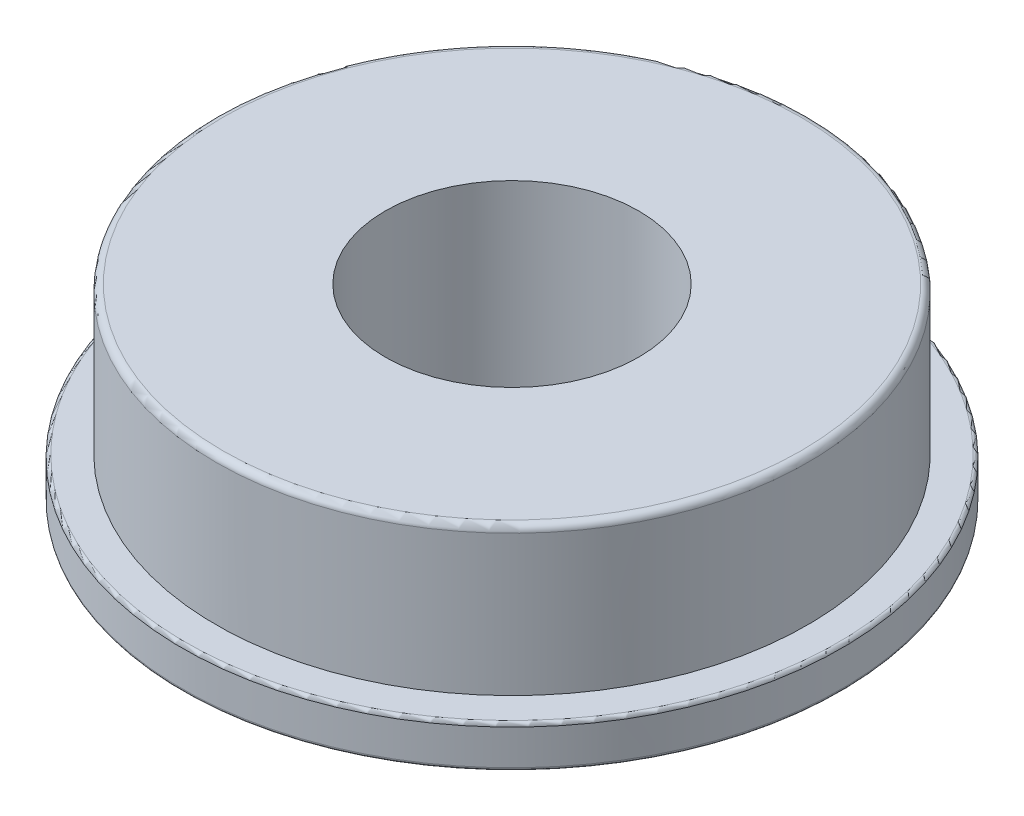
ISO-10303-21;
HEADER;
FILE_DESCRIPTION(('STEP AP214'),'2;1');
FILE_NAME('part.step','',(''),(''),'','','');
FILE_SCHEMA(('AUTOMOTIVE_DESIGN { 1 0 10303 214 1 1 1 1 }'));
ENDSEC;
DATA;
#1=APPLICATION_CONTEXT('core data for automotive mechanical design processes');
#2=APPLICATION_PROTOCOL_DEFINITION('international standard','automotive_design',2000,#1);
#3=PRODUCT_CONTEXT('',#1,'mechanical');
#4=PRODUCT('Part','Part','',(#3));
#5=PRODUCT_RELATED_PRODUCT_CATEGORY('part','',(#4));
#6=PRODUCT_DEFINITION_FORMATION('','',#4);
#7=PRODUCT_DEFINITION_CONTEXT('part definition',#1,'design');
#8=PRODUCT_DEFINITION('design','',#6,#7);
#9=PRODUCT_DEFINITION_SHAPE('','',#8);
#10=(LENGTH_UNIT() NAMED_UNIT(*) SI_UNIT(.MILLI.,.METRE.));
#11=(NAMED_UNIT(*) PLANE_ANGLE_UNIT() SI_UNIT($,.RADIAN.));
#12=(NAMED_UNIT(*) SI_UNIT($,.STERADIAN.) SOLID_ANGLE_UNIT());
#13=UNCERTAINTY_MEASURE_WITH_UNIT(LENGTH_MEASURE(1.E-05),#10,'distance_accuracy_value','');
#14=(GEOMETRIC_REPRESENTATION_CONTEXT(3) GLOBAL_UNCERTAINTY_ASSIGNED_CONTEXT((#13)) GLOBAL_UNIT_ASSIGNED_CONTEXT((#10,
#11,#12)) REPRESENTATION_CONTEXT('',''));
#15=CARTESIAN_POINT('',(0.,0.,0.));
#16=DIRECTION('',(0.,0.,1.));
#17=DIRECTION('',(1.,0.,0.));
#18=AXIS2_PLACEMENT_3D('',#15,#16,#17);
#19=CARTESIAN_POINT('',(0.,0.,0.));
#20=DIRECTION('',(0.,-1.,0.));
#21=DIRECTION('',(0.,0.,-1.));
#22=AXIS2_PLACEMENT_3D('',#19,#20,#21);
#23=CYLINDRICAL_SURFACE('',#22,11.1125);
#24=CARTESIAN_POINT('',(0.,1.5748,0.));
#25=DIRECTION('',(0.,-1.,0.));
#26=DIRECTION('',(0.,0.,-1.));
#27=AXIS2_PLACEMENT_3D('',#24,#25,#26);
#28=CIRCLE('',#27,11.1125);
#29=CARTESIAN_POINT('',(0.,1.5748,-11.1125));
#30=VERTEX_POINT('',#29);
#31=EDGE_CURVE('E19',#30,#30,#28,.T.);
#32=ORIENTED_EDGE('',*,*,#31,.F.);
#33=EDGE_LOOP('',(#32));
#34=FACE_BOUND('',#33,.T.);
#35=CARTESIAN_POINT('',(0.,6.858,0.));
#36=DIRECTION('',(0.,1.,0.));
#37=DIRECTION('',(-1.,0.,0.));
#38=AXIS2_PLACEMENT_3D('',#35,#36,#37);
#39=CIRCLE('',#38,11.1125);
#40=CARTESIAN_POINT('',(-11.1125,6.858,0.));
#41=VERTEX_POINT('',#40);
#42=EDGE_CURVE('E42',#41,#41,#39,.T.);
#43=ORIENTED_EDGE('',*,*,#42,.F.);
#44=EDGE_LOOP('',(#43));
#45=FACE_BOUND('',#44,.T.);
#46=ADVANCED_FACE('F15',(#34,#45),#23,.T.);
#47=CARTESIAN_POINT('',(11.1125,1.5748,0.));
#48=DIRECTION('',(0.,1.,0.));
#49=DIRECTION('',(0.,0.,1.));
#50=AXIS2_PLACEMENT_3D('',#47,#48,#49);
#51=PLANE('',#50);
#52=CARTESIAN_POINT('',(0.,1.5748,0.));
#53=DIRECTION('',(0.,1.,0.));
#54=DIRECTION('',(-1.,0.,0.));
#55=AXIS2_PLACEMENT_3D('',#52,#53,#54);
#56=CIRCLE('',#55,12.2555);
#57=CARTESIAN_POINT('',(-12.2555,1.5748,0.));
#58=VERTEX_POINT('',#57);
#59=EDGE_CURVE('E40',#58,#58,#56,.F.);
#60=ORIENTED_EDGE('',*,*,#59,.F.);
#61=EDGE_LOOP('',(#60));
#62=FACE_BOUND('',#61,.T.);
#63=ORIENTED_EDGE('',*,*,#31,.T.);
#64=EDGE_LOOP('',(#63));
#65=FACE_BOUND('',#64,.T.);
#66=ADVANCED_FACE('F78',(#62,#65),#51,.T.);
#67=CARTESIAN_POINT('',(0.,6.858,0.));
#68=DIRECTION('',(0.,1.,0.));
#69=DIRECTION('',(0.,0.,1.));
#70=AXIS2_PLACEMENT_3D('',#67,#68,#69);
#71=TOROIDAL_SURFACE('',#70,10.8585,0.254);
#72=CARTESIAN_POINT('',(0.,7.112,0.));
#73=DIRECTION('',(0.,1.,0.));
#74=DIRECTION('',(0.,0.,1.));
#75=AXIS2_PLACEMENT_3D('',#72,#73,#74);
#76=CIRCLE('',#75,10.8585);
#77=CARTESIAN_POINT('',(0.,7.112,10.8585));
#78=VERTEX_POINT('',#77);
#79=EDGE_CURVE('E38',#78,#78,#76,.T.);
#80=ORIENTED_EDGE('',*,*,#79,.F.);
#81=EDGE_LOOP('',(#80));
#82=FACE_BOUND('',#81,.T.);
#83=ORIENTED_EDGE('',*,*,#42,.T.);
#84=EDGE_LOOP('',(#83));
#85=FACE_BOUND('',#84,.T.);
#86=ADVANCED_FACE('F70',(#82,#85),#71,.T.);
#87=CARTESIAN_POINT('',(0.,1.4478,0.));
#88=DIRECTION('',(0.,1.,0.));
#89=DIRECTION('',(-1.,0.,0.));
#90=AXIS2_PLACEMENT_3D('',#87,#88,#89);
#91=TOROIDAL_SURFACE('',#90,12.2555,0.127000000000003);
#92=ORIENTED_EDGE('',*,*,#59,.T.);
#93=EDGE_LOOP('',(#92));
#94=FACE_BOUND('',#93,.T.);
#95=CARTESIAN_POINT('',(0.,1.4478,0.));
#96=DIRECTION('',(0.,-1.,0.));
#97=DIRECTION('',(0.,0.,-1.));
#98=AXIS2_PLACEMENT_3D('',#95,#96,#97);
#99=CIRCLE('',#98,12.3825);
#100=CARTESIAN_POINT('',(0.,1.4478,-12.3825));
#101=VERTEX_POINT('',#100);
#102=EDGE_CURVE('E37',#101,#101,#99,.T.);
#103=ORIENTED_EDGE('',*,*,#102,.F.);
#104=EDGE_LOOP('',(#103));
#105=FACE_BOUND('',#104,.T.);
#106=ADVANCED_FACE('F68',(#94,#105),#91,.T.);
#107=CARTESIAN_POINT('',(4.7625,7.112,0.));
#108=DIRECTION('',(0.,1.,0.));
#109=DIRECTION('',(0.,0.,1.));
#110=AXIS2_PLACEMENT_3D('',#107,#108,#109);
#111=PLANE('',#110);
#112=ORIENTED_EDGE('',*,*,#79,.T.);
#113=EDGE_LOOP('',(#112));
#114=FACE_BOUND('',#113,.T.);
#115=CARTESIAN_POINT('',(0.,7.112,0.));
#116=DIRECTION('',(0.,-1.,0.));
#117=DIRECTION('',(0.,0.,-1.));
#118=AXIS2_PLACEMENT_3D('',#115,#116,#117);
#119=CIRCLE('',#118,4.7625);
#120=CARTESIAN_POINT('',(0.,7.112,-4.7625));
#121=VERTEX_POINT('',#120);
#122=EDGE_CURVE('E34',#121,#121,#119,.T.);
#123=ORIENTED_EDGE('',*,*,#122,.T.);
#124=EDGE_LOOP('',(#123));
#125=FACE_BOUND('',#124,.T.);
#126=ADVANCED_FACE('F64',(#114,#125),#111,.T.);
#127=CARTESIAN_POINT('',(0.,0.,0.));
#128=DIRECTION('',(0.,-1.,0.));
#129=DIRECTION('',(0.,0.,-1.));
#130=AXIS2_PLACEMENT_3D('',#127,#128,#129);
#131=CYLINDRICAL_SURFACE('',#130,12.3825);
#132=CARTESIAN_POINT('',(0.,0.127,0.));
#133=DIRECTION('',(0.,-1.,0.));
#134=DIRECTION('',(0.,0.,-1.));
#135=AXIS2_PLACEMENT_3D('',#132,#133,#134);
#136=CIRCLE('',#135,12.3825);
#137=CARTESIAN_POINT('',(0.,0.127,-12.3825));
#138=VERTEX_POINT('',#137);
#139=EDGE_CURVE('E28',#138,#138,#136,.T.);
#140=ORIENTED_EDGE('',*,*,#139,.F.);
#141=EDGE_LOOP('',(#140));
#142=FACE_BOUND('',#141,.T.);
#143=ORIENTED_EDGE('',*,*,#102,.T.);
#144=EDGE_LOOP('',(#143));
#145=FACE_BOUND('',#144,.T.);
#146=ADVANCED_FACE('F60',(#142,#145),#131,.T.);
#147=CARTESIAN_POINT('',(0.,0.,0.));
#148=DIRECTION('',(0.,-1.,0.));
#149=DIRECTION('',(0.,0.,-1.));
#150=AXIS2_PLACEMENT_3D('',#147,#148,#149);
#151=CYLINDRICAL_SURFACE('',#150,4.7625);
#152=ORIENTED_EDGE('',*,*,#122,.F.);
#153=EDGE_LOOP('',(#152));
#154=FACE_BOUND('',#153,.T.);
#155=CARTESIAN_POINT('',(0.,0.,0.));
#156=DIRECTION('',(0.,-1.,0.));
#157=DIRECTION('',(0.,0.,-1.));
#158=AXIS2_PLACEMENT_3D('',#155,#156,#157);
#159=CIRCLE('',#158,4.7625);
#160=CARTESIAN_POINT('',(0.,0.,-4.7625));
#161=VERTEX_POINT('',#160);
#162=EDGE_CURVE('E23',#161,#161,#159,.F.);
#163=ORIENTED_EDGE('',*,*,#162,.F.);
#164=EDGE_LOOP('',(#163));
#165=FACE_BOUND('',#164,.T.);
#166=ADVANCED_FACE('F63',(#154,#165),#151,.F.);
#167=CARTESIAN_POINT('',(0.,0.127000000000003,0.));
#168=DIRECTION('',(0.,-1.,0.));
#169=DIRECTION('',(0.,0.,-1.));
#170=AXIS2_PLACEMENT_3D('',#167,#168,#169);
#171=TOROIDAL_SURFACE('',#170,12.2555,0.127000000000003);
#172=CARTESIAN_POINT('',(0.,0.,0.));
#173=DIRECTION('',(0.,-1.,0.));
#174=DIRECTION('',(0.,0.,-1.));
#175=AXIS2_PLACEMENT_3D('',#172,#173,#174);
#176=CIRCLE('',#175,12.2555);
#177=CARTESIAN_POINT('',(0.,0.,-12.2555));
#178=VERTEX_POINT('',#177);
#179=EDGE_CURVE('E10',#178,#178,#176,.T.);
#180=ORIENTED_EDGE('',*,*,#179,.F.);
#181=EDGE_LOOP('',(#180));
#182=FACE_BOUND('',#181,.T.);
#183=ORIENTED_EDGE('',*,*,#139,.T.);
#184=EDGE_LOOP('',(#183));
#185=FACE_BOUND('',#184,.T.);
#186=ADVANCED_FACE('F17',(#182,#185),#171,.T.);
#187=CARTESIAN_POINT('',(4.7625,0.,0.));
#188=DIRECTION('',(0.,-1.,0.));
#189=DIRECTION('',(0.,0.,-1.));
#190=AXIS2_PLACEMENT_3D('',#187,#188,#189);
#191=PLANE('',#190);
#192=ORIENTED_EDGE('',*,*,#179,.T.);
#193=EDGE_LOOP('',(#192));
#194=FACE_BOUND('',#193,.T.);
#195=ORIENTED_EDGE('',*,*,#162,.T.);
#196=EDGE_LOOP('',(#195));
#197=FACE_BOUND('',#196,.T.);
#198=ADVANCED_FACE('F81',(#194,#197),#191,.T.);
#199=CLOSED_SHELL('',(#46,#66,#86,#106,#126,#146,#166,#186,#198));
#200=MANIFOLD_SOLID_BREP('B1',#199);
#201=ADVANCED_BREP_SHAPE_REPRESENTATION('',(#18,#200),#14);
#202=SHAPE_DEFINITION_REPRESENTATION(#9,#201);
ENDSEC;
END-ISO-10303-21;
